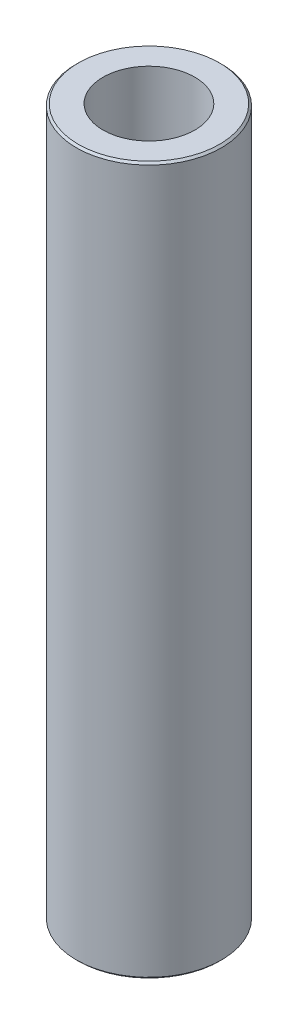
ISO-10303-21;
HEADER;
FILE_DESCRIPTION(('STEP AP214'),'2;1');
FILE_NAME('part.step','',(''),(''),'','','');
FILE_SCHEMA(('AUTOMOTIVE_DESIGN { 1 0 10303 214 1 1 1 1 }'));
ENDSEC;
DATA;
#1=APPLICATION_CONTEXT('core data for automotive mechanical design processes');
#2=APPLICATION_PROTOCOL_DEFINITION('international standard','automotive_design',2000,#1);
#3=PRODUCT_CONTEXT('',#1,'mechanical');
#4=PRODUCT('Part','Part','',(#3));
#5=PRODUCT_RELATED_PRODUCT_CATEGORY('part','',(#4));
#6=PRODUCT_DEFINITION_FORMATION('','',#4);
#7=PRODUCT_DEFINITION_CONTEXT('part definition',#1,'design');
#8=PRODUCT_DEFINITION('design','',#6,#7);
#9=PRODUCT_DEFINITION_SHAPE('','',#8);
#10=(LENGTH_UNIT() NAMED_UNIT(*) SI_UNIT(.MILLI.,.METRE.));
#11=(NAMED_UNIT(*) PLANE_ANGLE_UNIT() SI_UNIT($,.RADIAN.));
#12=(NAMED_UNIT(*) SI_UNIT($,.STERADIAN.) SOLID_ANGLE_UNIT());
#13=UNCERTAINTY_MEASURE_WITH_UNIT(LENGTH_MEASURE(1.E-05),#10,'distance_accuracy_value','');
#14=(GEOMETRIC_REPRESENTATION_CONTEXT(3) GLOBAL_UNCERTAINTY_ASSIGNED_CONTEXT((#13)) GLOBAL_UNIT_ASSIGNED_CONTEXT((#10,
#11,#12)) REPRESENTATION_CONTEXT('',''));
#15=CARTESIAN_POINT('',(0.,0.,0.));
#16=DIRECTION('',(0.,0.,1.));
#17=DIRECTION('',(1.,0.,0.));
#18=AXIS2_PLACEMENT_3D('',#15,#16,#17);
#19=CARTESIAN_POINT('',(0.,243.63717407428,0.));
#20=DIRECTION('',(0.,-1.,0.));
#21=DIRECTION('',(0.,0.,-1.));
#22=AXIS2_PLACEMENT_3D('',#19,#20,#21);
#23=CYLINDRICAL_SURFACE('',#22,25.);
#24=CARTESIAN_POINT('',(0.,242.959146710352,0.));
#25=DIRECTION('',(0.,1.,0.));
#26=DIRECTION('',(0.,0.,1.));
#27=AXIS2_PLACEMENT_3D('',#24,#25,#26);
#28=CIRCLE('',#27,25.);
#29=CARTESIAN_POINT('',(0.,242.959146710352,25.));
#30=VERTEX_POINT('',#29);
#31=EDGE_CURVE('E50',#30,#30,#28,.F.);
#32=ORIENTED_EDGE('',*,*,#31,.T.);
#33=EDGE_LOOP('',(#32));
#34=FACE_BOUND('',#33,.T.);
#35=CARTESIAN_POINT('',(0.,0.693335486525198,0.));
#36=DIRECTION('',(0.,1.,0.));
#37=DIRECTION('',(0.,0.,1.));
#38=AXIS2_PLACEMENT_3D('',#35,#36,#37);
#39=CIRCLE('',#38,25.);
#40=CARTESIAN_POINT('',(0.,0.693335486525198,25.));
#41=VERTEX_POINT('',#40);
#42=EDGE_CURVE('E51',#41,#41,#39,.T.);
#43=ORIENTED_EDGE('',*,*,#42,.T.);
#44=EDGE_LOOP('',(#43));
#45=FACE_BOUND('',#44,.T.);
#46=ADVANCED_FACE('F39',(#34,#45),#23,.T.);
#47=CARTESIAN_POINT('',(0.,243.63717407428,0.));
#48=DIRECTION('',(0.,1.,0.));
#49=DIRECTION('',(0.,0.,1.));
#50=AXIS2_PLACEMENT_3D('',#47,#48,#49);
#51=PLANE('',#50);
#52=CARTESIAN_POINT('',(0.,243.63717407428,0.));
#53=DIRECTION('',(0.,1.,0.));
#54=DIRECTION('',(0.,0.,1.));
#55=AXIS2_PLACEMENT_3D('',#52,#53,#54);
#56=CIRCLE('',#55,24.3066645134748);
#57=CARTESIAN_POINT('',(0.,243.63717407428,24.3066645134748));
#58=VERTEX_POINT('',#57);
#59=EDGE_CURVE('E54',#58,#58,#56,.T.);
#60=ORIENTED_EDGE('',*,*,#59,.T.);
#61=EDGE_LOOP('',(#60));
#62=FACE_BOUND('',#61,.T.);
#63=CARTESIAN_POINT('',(0.,243.63717407428,0.));
#64=DIRECTION('',(0.,1.,0.));
#65=DIRECTION('',(0.,0.,1.));
#66=AXIS2_PLACEMENT_3D('',#63,#64,#65);
#67=CIRCLE('',#66,15.8058969665115);
#68=CARTESIAN_POINT('',(0.,243.63717407428,15.8058969665115));
#69=VERTEX_POINT('',#68);
#70=EDGE_CURVE('E58',#69,#69,#67,.T.);
#71=ORIENTED_EDGE('',*,*,#70,.F.);
#72=EDGE_LOOP('',(#71));
#73=FACE_BOUND('',#72,.T.);
#74=ADVANCED_FACE('F69',(#62,#73),#51,.T.);
#75=CARTESIAN_POINT('',(0.,0.,0.));
#76=DIRECTION('',(0.,1.,0.));
#77=DIRECTION('',(0.,0.,1.));
#78=AXIS2_PLACEMENT_3D('',#75,#76,#77);
#79=PLANE('',#78);
#80=CARTESIAN_POINT('',(0.,0.,0.));
#81=DIRECTION('',(0.,1.,0.));
#82=DIRECTION('',(0.,0.,1.));
#83=AXIS2_PLACEMENT_3D('',#80,#81,#82);
#84=CIRCLE('',#83,24.3219726360723);
#85=CARTESIAN_POINT('',(0.,0.,24.3219726360723));
#86=VERTEX_POINT('',#85);
#87=EDGE_CURVE('E10',#86,#86,#84,.F.);
#88=ORIENTED_EDGE('',*,*,#87,.T.);
#89=EDGE_LOOP('',(#88));
#90=FACE_BOUND('',#89,.T.);
#91=CARTESIAN_POINT('',(0.,0.,0.));
#92=DIRECTION('',(0.,1.,0.));
#93=DIRECTION('',(0.,0.,1.));
#94=AXIS2_PLACEMENT_3D('',#91,#92,#93);
#95=CIRCLE('',#94,15.8058969665115);
#96=CARTESIAN_POINT('',(0.,0.,15.8058969665115));
#97=VERTEX_POINT('',#96);
#98=EDGE_CURVE('E63',#97,#97,#95,.T.);
#99=ORIENTED_EDGE('',*,*,#98,.T.);
#100=EDGE_LOOP('',(#99));
#101=FACE_BOUND('',#100,.T.);
#102=ADVANCED_FACE('F75',(#90,#101),#79,.F.);
#103=CARTESIAN_POINT('',(0.,243.63717407428,0.));
#104=DIRECTION('',(0.,-1.,0.));
#105=DIRECTION('',(0.,0.,-1.));
#106=AXIS2_PLACEMENT_3D('',#103,#104,#105);
#107=CYLINDRICAL_SURFACE('',#106,15.8058969665115);
#108=ORIENTED_EDGE('',*,*,#70,.T.);
#109=EDGE_LOOP('',(#108));
#110=FACE_BOUND('',#109,.T.);
#111=ORIENTED_EDGE('',*,*,#98,.F.);
#112=EDGE_LOOP('',(#111));
#113=FACE_BOUND('',#112,.T.);
#114=ADVANCED_FACE('F70',(#110,#113),#107,.F.);
#115=CARTESIAN_POINT('',(0.,243.63717407428,0.));
#116=DIRECTION('',(0.,-1.,0.));
#117=DIRECTION('',(0.,0.,-1.));
#118=AXIS2_PLACEMENT_3D('',#115,#116,#117);
#119=CONICAL_SURFACE('',#118,24.3066645134748,0.796560407446635);
#120=ORIENTED_EDGE('',*,*,#31,.F.);
#121=EDGE_LOOP('',(#120));
#122=FACE_BOUND('',#121,.T.);
#123=ORIENTED_EDGE('',*,*,#59,.F.);
#124=EDGE_LOOP('',(#123));
#125=FACE_BOUND('',#124,.T.);
#126=ADVANCED_FACE('F81',(#122,#125),#119,.T.);
#127=CARTESIAN_POINT('',(0.,0.693335486525198,0.));
#128=DIRECTION('',(0.,1.,0.));
#129=DIRECTION('',(0.,0.,1.));
#130=AXIS2_PLACEMENT_3D('',#127,#128,#129);
#131=CONICAL_SURFACE('',#130,25.,0.774235919348208);
#132=ORIENTED_EDGE('',*,*,#87,.F.);
#133=EDGE_LOOP('',(#132));
#134=FACE_BOUND('',#133,.T.);
#135=ORIENTED_EDGE('',*,*,#42,.F.);
#136=EDGE_LOOP('',(#135));
#137=FACE_BOUND('',#136,.T.);
#138=ADVANCED_FACE('F45',(#134,#137),#131,.T.);
#139=CLOSED_SHELL('',(#46,#74,#102,#114,#126,#138));
#140=MANIFOLD_SOLID_BREP('B2',#139);
#141=ADVANCED_BREP_SHAPE_REPRESENTATION('',(#18,#140),#14);
#142=SHAPE_DEFINITION_REPRESENTATION(#9,#141);
ENDSEC;
END-ISO-10303-21;
